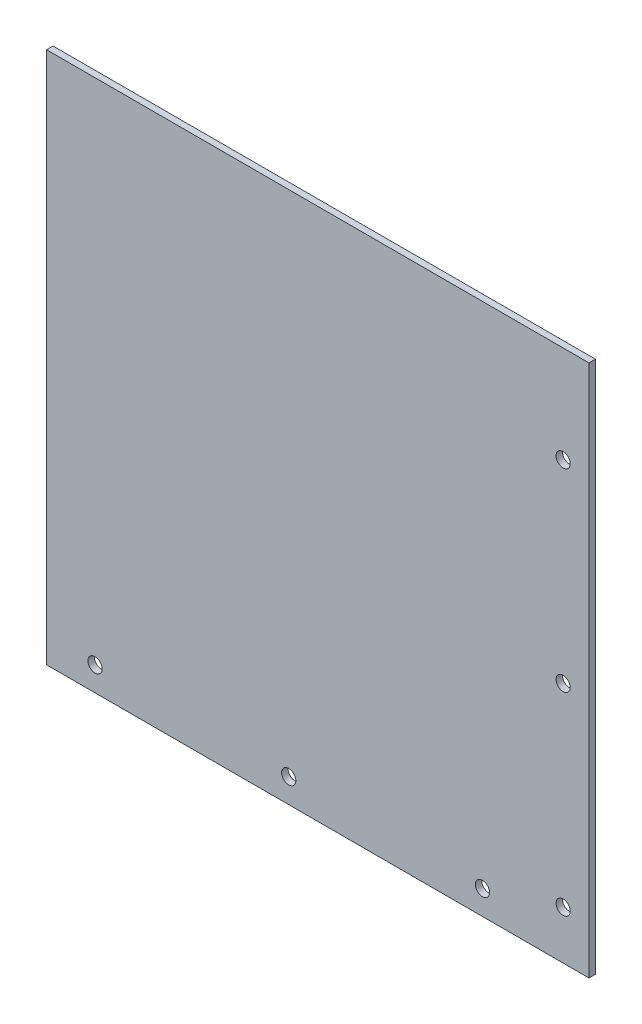
ISO-10303-21;
HEADER;
FILE_DESCRIPTION(('STEP AP214'),'2;1');
FILE_NAME('part.step','',(''),(''),'','','');
FILE_SCHEMA(('AUTOMOTIVE_DESIGN { 1 0 10303 214 1 1 1 1 }'));
ENDSEC;
DATA;
#1=APPLICATION_CONTEXT('core data for automotive mechanical design processes');
#2=APPLICATION_PROTOCOL_DEFINITION('international standard','automotive_design',2000,#1);
#3=PRODUCT_CONTEXT('',#1,'mechanical');
#4=PRODUCT('Part','Part','',(#3));
#5=PRODUCT_RELATED_PRODUCT_CATEGORY('part','',(#4));
#6=PRODUCT_DEFINITION_FORMATION('','',#4);
#7=PRODUCT_DEFINITION_CONTEXT('part definition',#1,'design');
#8=PRODUCT_DEFINITION('design','',#6,#7);
#9=PRODUCT_DEFINITION_SHAPE('','',#8);
#10=(LENGTH_UNIT() NAMED_UNIT(*) SI_UNIT(.MILLI.,.METRE.));
#11=(NAMED_UNIT(*) PLANE_ANGLE_UNIT() SI_UNIT($,.RADIAN.));
#12=(NAMED_UNIT(*) SI_UNIT($,.STERADIAN.) SOLID_ANGLE_UNIT());
#13=UNCERTAINTY_MEASURE_WITH_UNIT(LENGTH_MEASURE(1.E-05),#10,'distance_accuracy_value','');
#14=(GEOMETRIC_REPRESENTATION_CONTEXT(3) GLOBAL_UNCERTAINTY_ASSIGNED_CONTEXT((#13)) GLOBAL_UNIT_ASSIGNED_CONTEXT((#10,
#11,#12)) REPRESENTATION_CONTEXT('',''));
#15=CARTESIAN_POINT('',(0.,0.,0.));
#16=DIRECTION('',(0.,0.,1.));
#17=DIRECTION('',(1.,0.,0.));
#18=AXIS2_PLACEMENT_3D('',#15,#16,#17);
#19=CARTESIAN_POINT('',(84.,83.5,2.));
#20=DIRECTION('',(-1.,0.,0.));
#21=DIRECTION('',(0.,-1.,0.));
#22=AXIS2_PLACEMENT_3D('',#19,#20,#21);
#23=PLANE('',#22);
#24=DIRECTION('',(0.,1.,0.));
#25=VECTOR('',#24,1.);
#26=CARTESIAN_POINT('',(84.,83.5,0.));
#27=LINE('',#26,#25);
#28=CARTESIAN_POINT('',(84.,-83.5,0.));
#29=VERTEX_POINT('',#28);
#30=CARTESIAN_POINT('',(84.,81.5,0.));
#31=VERTEX_POINT('',#30);
#32=EDGE_CURVE('E89',#29,#31,#27,.T.);
#33=ORIENTED_EDGE('',*,*,#32,.T.);
#34=DIRECTION('',(0.,0.,-1.));
#35=VECTOR('',#34,1.);
#36=CARTESIAN_POINT('',(84.,81.5,2.));
#37=LINE('',#36,#35);
#38=CARTESIAN_POINT('',(84.,81.5,2.));
#39=VERTEX_POINT('',#38);
#40=EDGE_CURVE('E54',#39,#31,#37,.T.);
#41=ORIENTED_EDGE('',*,*,#40,.F.);
#42=DIRECTION('',(0.,1.,0.));
#43=VECTOR('',#42,1.);
#44=CARTESIAN_POINT('',(84.,83.5,2.));
#45=LINE('',#44,#43);
#46=CARTESIAN_POINT('',(84.,-83.5,2.));
#47=VERTEX_POINT('',#46);
#48=EDGE_CURVE('E84',#47,#39,#45,.T.);
#49=ORIENTED_EDGE('',*,*,#48,.F.);
#50=DIRECTION('',(0.,0.,-1.));
#51=VECTOR('',#50,1.);
#52=CARTESIAN_POINT('',(84.,-83.5,2.));
#53=LINE('',#52,#51);
#54=EDGE_CURVE('E47',#47,#29,#53,.T.);
#55=ORIENTED_EDGE('',*,*,#54,.T.);
#56=EDGE_LOOP('',(#33,#41,#49,#55));
#57=FACE_BOUND('',#56,.T.);
#58=ADVANCED_FACE('F39',(#57),#23,.F.);
#59=CARTESIAN_POINT('',(-84.,83.5,2.));
#60=DIRECTION('',(1.,0.,0.));
#61=DIRECTION('',(0.,1.,0.));
#62=AXIS2_PLACEMENT_3D('',#59,#60,#61);
#63=PLANE('',#62);
#64=DIRECTION('',(0.,-1.,0.));
#65=VECTOR('',#64,1.);
#66=CARTESIAN_POINT('',(-84.,83.5,2.));
#67=LINE('',#66,#65);
#68=CARTESIAN_POINT('',(-84.,81.5,2.));
#69=VERTEX_POINT('',#68);
#70=CARTESIAN_POINT('',(-84.,-83.5,2.));
#71=VERTEX_POINT('',#70);
#72=EDGE_CURVE('E105',#69,#71,#67,.T.);
#73=ORIENTED_EDGE('',*,*,#72,.F.);
#74=DIRECTION('',(0.,0.,1.));
#75=VECTOR('',#74,1.);
#76=CARTESIAN_POINT('',(-84.,81.5,2.));
#77=LINE('',#76,#75);
#78=CARTESIAN_POINT('',(-84.,81.5,0.));
#79=VERTEX_POINT('',#78);
#80=EDGE_CURVE('E136',#79,#69,#77,.T.);
#81=ORIENTED_EDGE('',*,*,#80,.F.);
#82=DIRECTION('',(0.,-1.,0.));
#83=VECTOR('',#82,1.);
#84=CARTESIAN_POINT('',(-84.,83.5,0.));
#85=LINE('',#84,#83);
#86=CARTESIAN_POINT('',(-84.,-83.5,0.));
#87=VERTEX_POINT('',#86);
#88=EDGE_CURVE('E85',#79,#87,#85,.T.);
#89=ORIENTED_EDGE('',*,*,#88,.T.);
#90=DIRECTION('',(0.,0.,-1.));
#91=VECTOR('',#90,1.);
#92=CARTESIAN_POINT('',(-84.,-83.5,2.));
#93=LINE('',#92,#91);
#94=EDGE_CURVE('E11',#71,#87,#93,.T.);
#95=ORIENTED_EDGE('',*,*,#94,.F.);
#96=EDGE_LOOP('',(#73,#81,#89,#95));
#97=FACE_BOUND('',#96,.T.);
#98=ADVANCED_FACE('F199',(#97),#63,.F.);
#99=CARTESIAN_POINT('',(-84.,-83.5,2.));
#100=DIRECTION('',(0.,1.,0.));
#101=DIRECTION('',(0.,0.,1.));
#102=AXIS2_PLACEMENT_3D('',#99,#100,#101);
#103=PLANE('',#102);
#104=DIRECTION('',(1.,0.,0.));
#105=VECTOR('',#104,1.);
#106=CARTESIAN_POINT('',(-84.,-83.5,0.));
#107=LINE('',#106,#105);
#108=EDGE_CURVE('E75',#87,#29,#107,.T.);
#109=ORIENTED_EDGE('',*,*,#108,.T.);
#110=ORIENTED_EDGE('',*,*,#54,.F.);
#111=DIRECTION('',(1.,0.,0.));
#112=VECTOR('',#111,1.);
#113=CARTESIAN_POINT('',(-84.,-83.5,2.));
#114=LINE('',#113,#112);
#115=EDGE_CURVE('E63',#71,#47,#114,.T.);
#116=ORIENTED_EDGE('',*,*,#115,.F.);
#117=ORIENTED_EDGE('',*,*,#94,.T.);
#118=EDGE_LOOP('',(#109,#110,#116,#117));
#119=FACE_BOUND('',#118,.T.);
#120=ADVANCED_FACE('F77',(#119),#103,.F.);
#121=CARTESIAN_POINT('',(0.,0.,2.));
#122=DIRECTION('',(0.,0.,1.));
#123=DIRECTION('',(1.,0.,0.));
#124=AXIS2_PLACEMENT_3D('',#121,#122,#123);
#125=PLANE('',#124);
#126=CARTESIAN_POINT('',(51.,-76.,2.));
#127=DIRECTION('',(0.,0.,1.));
#128=DIRECTION('',(1.,0.,0.));
#129=AXIS2_PLACEMENT_3D('',#126,#127,#128);
#130=CIRCLE('',#129,2.19999999999999);
#131=CARTESIAN_POINT('',(53.2,-76.,2.));
#132=VERTEX_POINT('',#131);
#133=EDGE_CURVE('E153',#132,#132,#130,.T.);
#134=ORIENTED_EDGE('',*,*,#133,.F.);
#135=EDGE_LOOP('',(#134));
#136=FACE_BOUND('',#135,.T.);
#137=CARTESIAN_POINT('',(-69.,-76.,2.));
#138=DIRECTION('',(0.,0.,1.));
#139=DIRECTION('',(1.,0.,0.));
#140=AXIS2_PLACEMENT_3D('',#137,#138,#139);
#141=CIRCLE('',#140,2.2);
#142=CARTESIAN_POINT('',(-66.8,-76.,2.));
#143=VERTEX_POINT('',#142);
#144=EDGE_CURVE('E145',#143,#143,#141,.T.);
#145=ORIENTED_EDGE('',*,*,#144,.F.);
#146=EDGE_LOOP('',(#145));
#147=FACE_BOUND('',#146,.T.);
#148=CARTESIAN_POINT('',(-9.00000000000001,-76.,2.));
#149=DIRECTION('',(0.,0.,1.));
#150=DIRECTION('',(1.,0.,0.));
#151=AXIS2_PLACEMENT_3D('',#148,#149,#150);
#152=CIRCLE('',#151,2.2);
#153=CARTESIAN_POINT('',(-6.80000000000001,-76.,2.));
#154=VERTEX_POINT('',#153);
#155=EDGE_CURVE('E141',#154,#154,#152,.T.);
#156=ORIENTED_EDGE('',*,*,#155,.F.);
#157=EDGE_LOOP('',(#156));
#158=FACE_BOUND('',#157,.T.);
#159=DIRECTION('',(1.,0.,0.));
#160=VECTOR('',#159,1.);
#161=CARTESIAN_POINT('',(-84.,81.5,2.));
#162=LINE('',#161,#160);
#163=EDGE_CURVE('E133',#69,#39,#162,.T.);
#164=ORIENTED_EDGE('',*,*,#163,.F.);
#165=ORIENTED_EDGE('',*,*,#72,.T.);
#166=ORIENTED_EDGE('',*,*,#115,.T.);
#167=ORIENTED_EDGE('',*,*,#48,.T.);
#168=EDGE_LOOP('',(#164,#165,#166,#167));
#169=FACE_BOUND('',#168,.T.);
#170=CARTESIAN_POINT('',(76.,51.5,2.));
#171=DIRECTION('',(0.,0.,1.));
#172=DIRECTION('',(1.,0.,0.));
#173=AXIS2_PLACEMENT_3D('',#170,#171,#172);
#174=CIRCLE('',#173,2.2);
#175=CARTESIAN_POINT('',(78.2,51.5,2.));
#176=VERTEX_POINT('',#175);
#177=EDGE_CURVE('E100',#176,#176,#174,.T.);
#178=ORIENTED_EDGE('',*,*,#177,.F.);
#179=EDGE_LOOP('',(#178));
#180=FACE_BOUND('',#179,.T.);
#181=CARTESIAN_POINT('',(76.,-8.50000000000001,2.));
#182=DIRECTION('',(0.,0.,1.));
#183=DIRECTION('',(1.,0.,0.));
#184=AXIS2_PLACEMENT_3D('',#181,#182,#183);
#185=CIRCLE('',#184,2.20000000000001);
#186=CARTESIAN_POINT('',(78.2,-8.50000000000001,2.));
#187=VERTEX_POINT('',#186);
#188=EDGE_CURVE('E118',#187,#187,#185,.T.);
#189=ORIENTED_EDGE('',*,*,#188,.F.);
#190=EDGE_LOOP('',(#189));
#191=FACE_BOUND('',#190,.T.);
#192=CARTESIAN_POINT('',(76.,-68.5,2.));
#193=DIRECTION('',(0.,0.,1.));
#194=DIRECTION('',(1.,0.,0.));
#195=AXIS2_PLACEMENT_3D('',#192,#193,#194);
#196=CIRCLE('',#195,2.2);
#197=CARTESIAN_POINT('',(78.2,-68.5,2.));
#198=VERTEX_POINT('',#197);
#199=EDGE_CURVE('E110',#198,#198,#196,.T.);
#200=ORIENTED_EDGE('',*,*,#199,.F.);
#201=EDGE_LOOP('',(#200));
#202=FACE_BOUND('',#201,.T.);
#203=ADVANCED_FACE('F167',(#136,#147,#158,#169,#180,#191,#202),#125,.T.);
#204=CARTESIAN_POINT('',(0.,0.,0.));
#205=DIRECTION('',(0.,0.,1.));
#206=DIRECTION('',(1.,0.,0.));
#207=AXIS2_PLACEMENT_3D('',#204,#205,#206);
#208=PLANE('',#207);
#209=CARTESIAN_POINT('',(51.,-76.,0.));
#210=DIRECTION('',(0.,0.,1.));
#211=DIRECTION('',(1.,0.,0.));
#212=AXIS2_PLACEMENT_3D('',#209,#210,#211);
#213=CIRCLE('',#212,2.19999999999999);
#214=CARTESIAN_POINT('',(53.2,-76.,0.));
#215=VERTEX_POINT('',#214);
#216=EDGE_CURVE('E149',#215,#215,#213,.T.);
#217=ORIENTED_EDGE('',*,*,#216,.T.);
#218=EDGE_LOOP('',(#217));
#219=FACE_BOUND('',#218,.T.);
#220=CARTESIAN_POINT('',(-69.,-76.,0.));
#221=DIRECTION('',(0.,0.,1.));
#222=DIRECTION('',(1.,0.,0.));
#223=AXIS2_PLACEMENT_3D('',#220,#221,#222);
#224=CIRCLE('',#223,2.2);
#225=CARTESIAN_POINT('',(-66.8,-76.,0.));
#226=VERTEX_POINT('',#225);
#227=EDGE_CURVE('E157',#226,#226,#224,.T.);
#228=ORIENTED_EDGE('',*,*,#227,.T.);
#229=EDGE_LOOP('',(#228));
#230=FACE_BOUND('',#229,.T.);
#231=CARTESIAN_POINT('',(-9.00000000000001,-76.,0.));
#232=DIRECTION('',(0.,0.,1.));
#233=DIRECTION('',(1.,0.,0.));
#234=AXIS2_PLACEMENT_3D('',#231,#232,#233);
#235=CIRCLE('',#234,2.2);
#236=CARTESIAN_POINT('',(-6.80000000000001,-76.,0.));
#237=VERTEX_POINT('',#236);
#238=EDGE_CURVE('E140',#237,#237,#235,.T.);
#239=ORIENTED_EDGE('',*,*,#238,.T.);
#240=EDGE_LOOP('',(#239));
#241=FACE_BOUND('',#240,.T.);
#242=CARTESIAN_POINT('',(76.,51.5,0.));
#243=DIRECTION('',(0.,0.,1.));
#244=DIRECTION('',(1.,0.,0.));
#245=AXIS2_PLACEMENT_3D('',#242,#243,#244);
#246=CIRCLE('',#245,2.2);
#247=CARTESIAN_POINT('',(78.2,51.5,0.));
#248=VERTEX_POINT('',#247);
#249=EDGE_CURVE('E94',#248,#248,#246,.T.);
#250=ORIENTED_EDGE('',*,*,#249,.T.);
#251=EDGE_LOOP('',(#250));
#252=FACE_BOUND('',#251,.T.);
#253=CARTESIAN_POINT('',(76.,-8.50000000000001,0.));
#254=DIRECTION('',(0.,0.,1.));
#255=DIRECTION('',(1.,0.,0.));
#256=AXIS2_PLACEMENT_3D('',#253,#254,#255);
#257=CIRCLE('',#256,2.20000000000001);
#258=CARTESIAN_POINT('',(78.2,-8.50000000000001,0.));
#259=VERTEX_POINT('',#258);
#260=EDGE_CURVE('E122',#259,#259,#257,.T.);
#261=ORIENTED_EDGE('',*,*,#260,.T.);
#262=EDGE_LOOP('',(#261));
#263=FACE_BOUND('',#262,.T.);
#264=CARTESIAN_POINT('',(76.,-68.5,0.));
#265=DIRECTION('',(0.,0.,1.));
#266=DIRECTION('',(1.,0.,0.));
#267=AXIS2_PLACEMENT_3D('',#264,#265,#266);
#268=CIRCLE('',#267,2.2);
#269=CARTESIAN_POINT('',(78.2,-68.5,0.));
#270=VERTEX_POINT('',#269);
#271=EDGE_CURVE('E114',#270,#270,#268,.T.);
#272=ORIENTED_EDGE('',*,*,#271,.T.);
#273=EDGE_LOOP('',(#272));
#274=FACE_BOUND('',#273,.T.);
#275=ORIENTED_EDGE('',*,*,#88,.F.);
#276=DIRECTION('',(-1.,0.,0.));
#277=VECTOR('',#276,1.);
#278=CARTESIAN_POINT('',(-84.,81.5,0.));
#279=LINE('',#278,#277);
#280=EDGE_CURVE('E92',#31,#79,#279,.T.);
#281=ORIENTED_EDGE('',*,*,#280,.F.);
#282=ORIENTED_EDGE('',*,*,#32,.F.);
#283=ORIENTED_EDGE('',*,*,#108,.F.);
#284=EDGE_LOOP('',(#275,#281,#282,#283));
#285=FACE_BOUND('',#284,.T.);
#286=ADVANCED_FACE('F91',(#219,#230,#241,#252,#263,#274,#285),#208,.F.);
#287=CARTESIAN_POINT('',(76.,-68.5,0.));
#288=DIRECTION('',(0.,0.,1.));
#289=DIRECTION('',(1.,0.,0.));
#290=AXIS2_PLACEMENT_3D('',#287,#288,#289);
#291=CYLINDRICAL_SURFACE('',#290,2.2);
#292=ORIENTED_EDGE('',*,*,#271,.F.);
#293=EDGE_LOOP('',(#292));
#294=FACE_BOUND('',#293,.T.);
#295=ORIENTED_EDGE('',*,*,#199,.T.);
#296=EDGE_LOOP('',(#295));
#297=FACE_BOUND('',#296,.T.);
#298=ADVANCED_FACE('F183',(#294,#297),#291,.F.);
#299=CARTESIAN_POINT('',(76.,-8.50000000000001,0.));
#300=DIRECTION('',(0.,0.,1.));
#301=DIRECTION('',(1.,0.,0.));
#302=AXIS2_PLACEMENT_3D('',#299,#300,#301);
#303=CYLINDRICAL_SURFACE('',#302,2.20000000000001);
#304=ORIENTED_EDGE('',*,*,#260,.F.);
#305=EDGE_LOOP('',(#304));
#306=FACE_BOUND('',#305,.T.);
#307=ORIENTED_EDGE('',*,*,#188,.T.);
#308=EDGE_LOOP('',(#307));
#309=FACE_BOUND('',#308,.T.);
#310=ADVANCED_FACE('F185',(#306,#309),#303,.F.);
#311=CARTESIAN_POINT('',(76.,51.5,0.));
#312=DIRECTION('',(0.,0.,1.));
#313=DIRECTION('',(1.,0.,0.));
#314=AXIS2_PLACEMENT_3D('',#311,#312,#313);
#315=CYLINDRICAL_SURFACE('',#314,2.2);
#316=ORIENTED_EDGE('',*,*,#249,.F.);
#317=EDGE_LOOP('',(#316));
#318=FACE_BOUND('',#317,.T.);
#319=ORIENTED_EDGE('',*,*,#177,.T.);
#320=EDGE_LOOP('',(#319));
#321=FACE_BOUND('',#320,.T.);
#322=ADVANCED_FACE('F192',(#318,#321),#315,.F.);
#323=CARTESIAN_POINT('',(0.,81.5,0.));
#324=DIRECTION('',(0.,-1.,0.));
#325=DIRECTION('',(0.,0.,-1.));
#326=AXIS2_PLACEMENT_3D('',#323,#324,#325);
#327=PLANE('',#326);
#328=ORIENTED_EDGE('',*,*,#80,.T.);
#329=ORIENTED_EDGE('',*,*,#163,.T.);
#330=ORIENTED_EDGE('',*,*,#40,.T.);
#331=ORIENTED_EDGE('',*,*,#280,.T.);
#332=EDGE_LOOP('',(#328,#329,#330,#331));
#333=FACE_BOUND('',#332,.T.);
#334=ADVANCED_FACE('F212',(#333),#327,.F.);
#335=CARTESIAN_POINT('',(-9.00000000000001,-76.,0.));
#336=DIRECTION('',(0.,0.,1.));
#337=DIRECTION('',(1.,0.,0.));
#338=AXIS2_PLACEMENT_3D('',#335,#336,#337);
#339=CYLINDRICAL_SURFACE('',#338,2.2);
#340=ORIENTED_EDGE('',*,*,#238,.F.);
#341=EDGE_LOOP('',(#340));
#342=FACE_BOUND('',#341,.T.);
#343=ORIENTED_EDGE('',*,*,#155,.T.);
#344=EDGE_LOOP('',(#343));
#345=FACE_BOUND('',#344,.T.);
#346=ADVANCED_FACE('F214',(#342,#345),#339,.F.);
#347=CARTESIAN_POINT('',(-69.,-76.,0.));
#348=DIRECTION('',(0.,0.,1.));
#349=DIRECTION('',(1.,0.,0.));
#350=AXIS2_PLACEMENT_3D('',#347,#348,#349);
#351=CYLINDRICAL_SURFACE('',#350,2.2);
#352=ORIENTED_EDGE('',*,*,#227,.F.);
#353=EDGE_LOOP('',(#352));
#354=FACE_BOUND('',#353,.T.);
#355=ORIENTED_EDGE('',*,*,#144,.T.);
#356=EDGE_LOOP('',(#355));
#357=FACE_BOUND('',#356,.T.);
#358=ADVANCED_FACE('F165',(#354,#357),#351,.F.);
#359=CARTESIAN_POINT('',(51.,-76.,0.));
#360=DIRECTION('',(0.,0.,1.));
#361=DIRECTION('',(1.,0.,0.));
#362=AXIS2_PLACEMENT_3D('',#359,#360,#361);
#363=CYLINDRICAL_SURFACE('',#362,2.19999999999999);
#364=ORIENTED_EDGE('',*,*,#216,.F.);
#365=EDGE_LOOP('',(#364));
#366=FACE_BOUND('',#365,.T.);
#367=ORIENTED_EDGE('',*,*,#133,.T.);
#368=EDGE_LOOP('',(#367));
#369=FACE_BOUND('',#368,.T.);
#370=ADVANCED_FACE('F225',(#366,#369),#363,.F.);
#371=CLOSED_SHELL('',(#58,#98,#120,#203,#286,#298,#310,#322,#334,#346,#358,#370));
#372=MANIFOLD_SOLID_BREP('B2',#371);
#373=ADVANCED_BREP_SHAPE_REPRESENTATION('',(#18,#372),#14);
#374=SHAPE_DEFINITION_REPRESENTATION(#9,#373);
ENDSEC;
END-ISO-10303-21;
